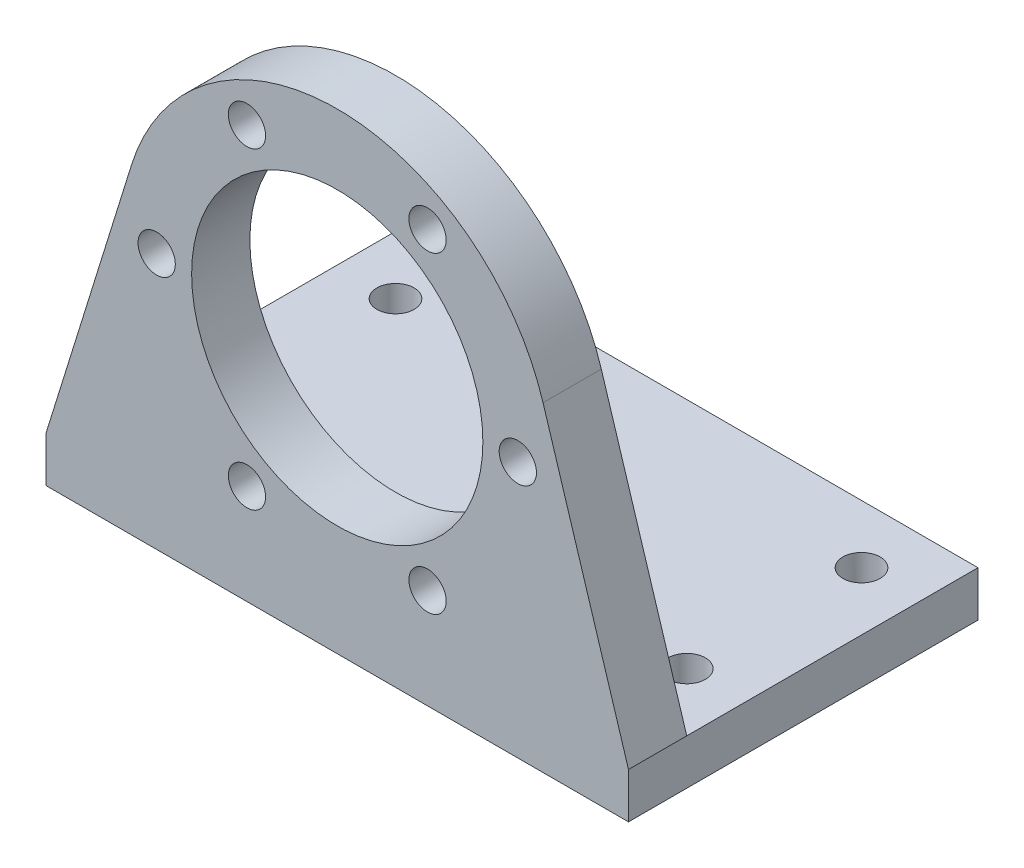
ISO-10303-21;
HEADER;
FILE_DESCRIPTION(('STEP AP214'),'2;1');
FILE_NAME('part.step','',(''),(''),'','','');
FILE_SCHEMA(('AUTOMOTIVE_DESIGN { 1 0 10303 214 1 1 1 1 }'));
ENDSEC;
DATA;
#1=APPLICATION_CONTEXT('core data for automotive mechanical design processes');
#2=APPLICATION_PROTOCOL_DEFINITION('international standard','automotive_design',2000,#1);
#3=PRODUCT_CONTEXT('',#1,'mechanical');
#4=PRODUCT('Part','Part','',(#3));
#5=PRODUCT_RELATED_PRODUCT_CATEGORY('part','',(#4));
#6=PRODUCT_DEFINITION_FORMATION('','',#4);
#7=PRODUCT_DEFINITION_CONTEXT('part definition',#1,'design');
#8=PRODUCT_DEFINITION('design','',#6,#7);
#9=PRODUCT_DEFINITION_SHAPE('','',#8);
#10=(LENGTH_UNIT() NAMED_UNIT(*) SI_UNIT(.MILLI.,.METRE.));
#11=(NAMED_UNIT(*) PLANE_ANGLE_UNIT() SI_UNIT($,.RADIAN.));
#12=(NAMED_UNIT(*) SI_UNIT($,.STERADIAN.) SOLID_ANGLE_UNIT());
#13=UNCERTAINTY_MEASURE_WITH_UNIT(LENGTH_MEASURE(1.E-05),#10,'distance_accuracy_value','');
#14=(GEOMETRIC_REPRESENTATION_CONTEXT(3) GLOBAL_UNCERTAINTY_ASSIGNED_CONTEXT((#13)) GLOBAL_UNIT_ASSIGNED_CONTEXT((#10,
#11,#12)) REPRESENTATION_CONTEXT('',''));
#15=CARTESIAN_POINT('',(0.,0.,0.));
#16=DIRECTION('',(0.,0.,1.));
#17=DIRECTION('',(1.,0.,0.));
#18=AXIS2_PLACEMENT_3D('',#15,#16,#17);
#19=CARTESIAN_POINT('',(0.,0.,0.));
#20=DIRECTION('',(0.,0.,1.));
#21=DIRECTION('',(1.,0.,0.));
#22=AXIS2_PLACEMENT_3D('',#19,#20,#21);
#23=PLANE('',#22);
#24=CARTESIAN_POINT('',(-7.75000000000016,-13.4233937586587,0.));
#25=DIRECTION('',(0.,0.,1.));
#26=DIRECTION('',(1.,0.,0.));
#27=AXIS2_PLACEMENT_3D('',#24,#25,#26);
#28=CIRCLE('',#27,1.6);
#29=CARTESIAN_POINT('',(-6.15000000000015,-13.4233937586587,0.));
#30=VERTEX_POINT('',#29);
#31=EDGE_CURVE('E190',#30,#30,#28,.T.);
#32=ORIENTED_EDGE('',*,*,#31,.T.);
#33=EDGE_LOOP('',(#32));
#34=FACE_BOUND('',#33,.T.);
#35=CARTESIAN_POINT('',(7.74999999999987,-13.4233937586589,0.));
#36=DIRECTION('',(0.,0.,1.));
#37=DIRECTION('',(1.,0.,0.));
#38=AXIS2_PLACEMENT_3D('',#35,#36,#37);
#39=CIRCLE('',#38,1.6);
#40=CARTESIAN_POINT('',(9.34999999999988,-13.4233937586589,0.));
#41=VERTEX_POINT('',#40);
#42=EDGE_CURVE('E195',#41,#41,#39,.T.);
#43=ORIENTED_EDGE('',*,*,#42,.T.);
#44=EDGE_LOOP('',(#43));
#45=FACE_BOUND('',#44,.T.);
#46=CARTESIAN_POINT('',(15.5,-1.08235921504137E-13,0.));
#47=DIRECTION('',(0.,0.,1.));
#48=DIRECTION('',(1.,0.,0.));
#49=AXIS2_PLACEMENT_3D('',#46,#47,#48);
#50=CIRCLE('',#49,1.6);
#51=CARTESIAN_POINT('',(17.1,-1.08235921504137E-13,0.));
#52=VERTEX_POINT('',#51);
#53=EDGE_CURVE('E203',#52,#52,#50,.T.);
#54=ORIENTED_EDGE('',*,*,#53,.T.);
#55=EDGE_LOOP('',(#54));
#56=FACE_BOUND('',#55,.T.);
#57=CARTESIAN_POINT('',(7.75000000000006,13.4233937586588,0.));
#58=DIRECTION('',(0.,0.,1.));
#59=DIRECTION('',(1.,0.,0.));
#60=AXIS2_PLACEMENT_3D('',#57,#58,#59);
#61=CIRCLE('',#60,1.6);
#62=CARTESIAN_POINT('',(9.35000000000006,13.4233937586588,0.));
#63=VERTEX_POINT('',#62);
#64=EDGE_CURVE('E211',#63,#63,#61,.T.);
#65=ORIENTED_EDGE('',*,*,#64,.T.);
#66=EDGE_LOOP('',(#65));
#67=FACE_BOUND('',#66,.T.);
#68=CARTESIAN_POINT('',(-7.74999999999997,13.4233937586588,0.));
#69=DIRECTION('',(0.,0.,1.));
#70=DIRECTION('',(1.,0.,0.));
#71=AXIS2_PLACEMENT_3D('',#68,#69,#70);
#72=CIRCLE('',#71,1.6);
#73=CARTESIAN_POINT('',(-6.14999999999997,13.4233937586588,0.));
#74=VERTEX_POINT('',#73);
#75=EDGE_CURVE('E219',#74,#74,#72,.T.);
#76=ORIENTED_EDGE('',*,*,#75,.T.);
#77=EDGE_LOOP('',(#76));
#78=FACE_BOUND('',#77,.T.);
#79=CARTESIAN_POINT('',(0.,0.,0.));
#80=DIRECTION('',(0.,0.,1.));
#81=DIRECTION('',(1.,0.,0.));
#82=AXIS2_PLACEMENT_3D('',#79,#80,#81);
#83=CIRCLE('',#82,12.5);
#84=CARTESIAN_POINT('',(12.5,0.,0.));
#85=VERTEX_POINT('',#84);
#86=EDGE_CURVE('E227',#85,#85,#83,.T.);
#87=ORIENTED_EDGE('',*,*,#86,.T.);
#88=EDGE_LOOP('',(#87));
#89=FACE_BOUND('',#88,.T.);
#90=CARTESIAN_POINT('',(-15.5,0.,0.));
#91=DIRECTION('',(0.,0.,1.));
#92=DIRECTION('',(1.,0.,0.));
#93=AXIS2_PLACEMENT_3D('',#90,#91,#92);
#94=CIRCLE('',#93,1.6);
#95=CARTESIAN_POINT('',(-13.9,0.,0.));
#96=VERTEX_POINT('',#95);
#97=EDGE_CURVE('E235',#96,#96,#94,.T.);
#98=ORIENTED_EDGE('',*,*,#97,.T.);
#99=EDGE_LOOP('',(#98));
#100=FACE_BOUND('',#99,.T.);
#101=DIRECTION('',(1.,0.,0.));
#102=VECTOR('',#101,1.);
#103=CARTESIAN_POINT('',(25.,-18.1033033888757,0.));
#104=LINE('',#103,#102);
#105=CARTESIAN_POINT('',(-25.,-18.1033033888757,0.));
#106=VERTEX_POINT('',#105);
#107=CARTESIAN_POINT('',(25.,-18.1033033888757,0.));
#108=VERTEX_POINT('',#107);
#109=EDGE_CURVE('E84',#106,#108,#104,.T.);
#110=ORIENTED_EDGE('',*,*,#109,.F.);
#111=DIRECTION('',(-0.296816662870677,-0.95493448395286,0.));
#112=VECTOR('',#111,1.);
#113=CARTESIAN_POINT('',(-25.,-18.1033033888757,0.));
#114=LINE('',#113,#112);
#115=CARTESIAN_POINT('',(-17.6662879531279,5.49110826310753,0.));
#116=VERTEX_POINT('',#115);
#117=EDGE_CURVE('E135',#116,#106,#114,.T.);
#118=ORIENTED_EDGE('',*,*,#117,.F.);
#119=CARTESIAN_POINT('',(0.,0.,0.));
#120=DIRECTION('',(0.,0.,1.));
#121=DIRECTION('',(1.,0.,0.));
#122=AXIS2_PLACEMENT_3D('',#119,#120,#121);
#123=CIRCLE('',#122,18.5);
#124=CARTESIAN_POINT('',(17.6662879531279,5.49110826310752,0.));
#125=VERTEX_POINT('',#124);
#126=EDGE_CURVE('E76',#125,#116,#123,.T.);
#127=ORIENTED_EDGE('',*,*,#126,.F.);
#128=DIRECTION('',(-0.296816662870677,0.95493448395286,0.));
#129=VECTOR('',#128,1.);
#130=CARTESIAN_POINT('',(25.,-18.1033033888757,0.));
#131=LINE('',#130,#129);
#132=EDGE_CURVE('E117',#108,#125,#131,.T.);
#133=ORIENTED_EDGE('',*,*,#132,.F.);
#134=EDGE_LOOP('',(#110,#118,#127,#133));
#135=FACE_BOUND('',#134,.T.);
#136=ADVANCED_FACE('F43',(#34,#45,#56,#67,#78,#89,#100,#135),#23,.F.);
#137=CARTESIAN_POINT('',(0.,0.,5.));
#138=DIRECTION('',(0.,0.,1.));
#139=DIRECTION('',(1.,0.,0.));
#140=AXIS2_PLACEMENT_3D('',#137,#138,#139);
#141=PLANE('',#140);
#142=CARTESIAN_POINT('',(7.74999999999987,-13.4233937586589,5.));
#143=DIRECTION('',(0.,0.,1.));
#144=DIRECTION('',(1.,0.,0.));
#145=AXIS2_PLACEMENT_3D('',#142,#143,#144);
#146=CIRCLE('',#145,1.6);
#147=CARTESIAN_POINT('',(9.34999999999988,-13.4233937586589,5.));
#148=VERTEX_POINT('',#147);
#149=EDGE_CURVE('E199',#148,#148,#146,.T.);
#150=ORIENTED_EDGE('',*,*,#149,.F.);
#151=EDGE_LOOP('',(#150));
#152=FACE_BOUND('',#151,.T.);
#153=CARTESIAN_POINT('',(7.75000000000006,13.4233937586588,5.));
#154=DIRECTION('',(0.,0.,1.));
#155=DIRECTION('',(1.,0.,0.));
#156=AXIS2_PLACEMENT_3D('',#153,#154,#155);
#157=CIRCLE('',#156,1.6);
#158=CARTESIAN_POINT('',(9.35000000000006,13.4233937586588,5.));
#159=VERTEX_POINT('',#158);
#160=EDGE_CURVE('E215',#159,#159,#157,.T.);
#161=ORIENTED_EDGE('',*,*,#160,.F.);
#162=EDGE_LOOP('',(#161));
#163=FACE_BOUND('',#162,.T.);
#164=CARTESIAN_POINT('',(0.,0.,5.));
#165=DIRECTION('',(0.,0.,1.));
#166=DIRECTION('',(1.,0.,0.));
#167=AXIS2_PLACEMENT_3D('',#164,#165,#166);
#168=CIRCLE('',#167,12.5);
#169=CARTESIAN_POINT('',(12.5,0.,5.));
#170=VERTEX_POINT('',#169);
#171=EDGE_CURVE('E231',#170,#170,#168,.T.);
#172=ORIENTED_EDGE('',*,*,#171,.F.);
#173=EDGE_LOOP('',(#172));
#174=FACE_BOUND('',#173,.T.);
#175=DIRECTION('',(0.,-1.,0.));
#176=VECTOR('',#175,1.);
#177=CARTESIAN_POINT('',(-25.,-22.,5.));
#178=LINE('',#177,#176);
#179=CARTESIAN_POINT('',(-25.,-18.1033033888757,5.));
#180=VERTEX_POINT('',#179);
#181=CARTESIAN_POINT('',(-25.,-22.,5.));
#182=VERTEX_POINT('',#181);
#183=EDGE_CURVE('E138',#180,#182,#178,.T.);
#184=ORIENTED_EDGE('',*,*,#183,.T.);
#185=DIRECTION('',(1.,0.,0.));
#186=VECTOR('',#185,1.);
#187=CARTESIAN_POINT('',(-25.,-22.,5.));
#188=LINE('',#187,#186);
#189=CARTESIAN_POINT('',(25.,-22.,5.));
#190=VERTEX_POINT('',#189);
#191=EDGE_CURVE('E92',#182,#190,#188,.T.);
#192=ORIENTED_EDGE('',*,*,#191,.T.);
#193=DIRECTION('',(0.,1.,0.));
#194=VECTOR('',#193,1.);
#195=CARTESIAN_POINT('',(25.,-22.,5.));
#196=LINE('',#195,#194);
#197=CARTESIAN_POINT('',(25.,-18.1033033888757,5.));
#198=VERTEX_POINT('',#197);
#199=EDGE_CURVE('E109',#190,#198,#196,.T.);
#200=ORIENTED_EDGE('',*,*,#199,.T.);
#201=DIRECTION('',(-0.296816662870677,0.95493448395286,0.));
#202=VECTOR('',#201,1.);
#203=CARTESIAN_POINT('',(25.,-18.1033033888757,5.));
#204=LINE('',#203,#202);
#205=CARTESIAN_POINT('',(17.6662879531279,5.49110826310752,5.));
#206=VERTEX_POINT('',#205);
#207=EDGE_CURVE('E102',#198,#206,#204,.T.);
#208=ORIENTED_EDGE('',*,*,#207,.T.);
#209=CARTESIAN_POINT('',(0.,0.,5.));
#210=DIRECTION('',(0.,0.,1.));
#211=DIRECTION('',(1.,0.,0.));
#212=AXIS2_PLACEMENT_3D('',#209,#210,#211);
#213=CIRCLE('',#212,18.5);
#214=CARTESIAN_POINT('',(-17.6662879531279,5.49110826310753,5.));
#215=VERTEX_POINT('',#214);
#216=EDGE_CURVE('E107',#206,#215,#213,.T.);
#217=ORIENTED_EDGE('',*,*,#216,.T.);
#218=DIRECTION('',(-0.296816662870677,-0.95493448395286,0.));
#219=VECTOR('',#218,1.);
#220=CARTESIAN_POINT('',(-25.,-18.1033033888757,5.));
#221=LINE('',#220,#219);
#222=EDGE_CURVE('E61',#215,#180,#221,.T.);
#223=ORIENTED_EDGE('',*,*,#222,.T.);
#224=EDGE_LOOP('',(#184,#192,#200,#208,#217,#223));
#225=FACE_BOUND('',#224,.T.);
#226=CARTESIAN_POINT('',(-15.5,0.,5.));
#227=DIRECTION('',(0.,0.,1.));
#228=DIRECTION('',(1.,0.,0.));
#229=AXIS2_PLACEMENT_3D('',#226,#227,#228);
#230=CIRCLE('',#229,1.6);
#231=CARTESIAN_POINT('',(-13.9,0.,5.));
#232=VERTEX_POINT('',#231);
#233=EDGE_CURVE('E132',#232,#232,#230,.T.);
#234=ORIENTED_EDGE('',*,*,#233,.F.);
#235=EDGE_LOOP('',(#234));
#236=FACE_BOUND('',#235,.T.);
#237=CARTESIAN_POINT('',(-7.74999999999997,13.4233937586588,5.));
#238=DIRECTION('',(0.,0.,1.));
#239=DIRECTION('',(1.,0.,0.));
#240=AXIS2_PLACEMENT_3D('',#237,#238,#239);
#241=CIRCLE('',#240,1.6);
#242=CARTESIAN_POINT('',(-6.14999999999997,13.4233937586588,5.));
#243=VERTEX_POINT('',#242);
#244=EDGE_CURVE('E223',#243,#243,#241,.T.);
#245=ORIENTED_EDGE('',*,*,#244,.F.);
#246=EDGE_LOOP('',(#245));
#247=FACE_BOUND('',#246,.T.);
#248=CARTESIAN_POINT('',(15.5,-1.08235921504137E-13,5.));
#249=DIRECTION('',(0.,0.,1.));
#250=DIRECTION('',(1.,0.,0.));
#251=AXIS2_PLACEMENT_3D('',#248,#249,#250);
#252=CIRCLE('',#251,1.6);
#253=CARTESIAN_POINT('',(17.1,-1.08235921504137E-13,5.));
#254=VERTEX_POINT('',#253);
#255=EDGE_CURVE('E207',#254,#254,#252,.T.);
#256=ORIENTED_EDGE('',*,*,#255,.F.);
#257=EDGE_LOOP('',(#256));
#258=FACE_BOUND('',#257,.T.);
#259=CARTESIAN_POINT('',(-7.75000000000016,-13.4233937586587,5.));
#260=DIRECTION('',(0.,0.,1.));
#261=DIRECTION('',(1.,0.,0.));
#262=AXIS2_PLACEMENT_3D('',#259,#260,#261);
#263=CIRCLE('',#262,1.6);
#264=CARTESIAN_POINT('',(-6.15000000000015,-13.4233937586587,5.));
#265=VERTEX_POINT('',#264);
#266=EDGE_CURVE('E191',#265,#265,#263,.T.);
#267=ORIENTED_EDGE('',*,*,#266,.F.);
#268=EDGE_LOOP('',(#267));
#269=FACE_BOUND('',#268,.T.);
#270=ADVANCED_FACE('F104',(#152,#163,#174,#225,#236,#247,#258,#269),#141,.T.);
#271=CARTESIAN_POINT('',(-25.,-22.,5.));
#272=DIRECTION('',(1.,0.,0.));
#273=DIRECTION('',(0.,0.,-1.));
#274=AXIS2_PLACEMENT_3D('',#271,#272,#273);
#275=PLANE('',#274);
#276=DIRECTION('',(0.,0.,-1.));
#277=VECTOR('',#276,1.);
#278=CARTESIAN_POINT('',(-25.,-18.1033033888757,5.));
#279=LINE('',#278,#277);
#280=EDGE_CURVE('E126',#180,#106,#279,.T.);
#281=ORIENTED_EDGE('',*,*,#280,.T.);
#282=DIRECTION('',(0.,0.,1.));
#283=VECTOR('',#282,1.);
#284=CARTESIAN_POINT('',(-25.,-18.1033033888757,-25.));
#285=LINE('',#284,#283);
#286=CARTESIAN_POINT('',(-25.,-18.1033033888757,-25.));
#287=VERTEX_POINT('',#286);
#288=EDGE_CURVE('E186',#287,#106,#285,.T.);
#289=ORIENTED_EDGE('',*,*,#288,.F.);
#290=DIRECTION('',(0.,1.,0.));
#291=VECTOR('',#290,1.);
#292=CARTESIAN_POINT('',(-25.,-18.1033033888757,-25.));
#293=LINE('',#292,#291);
#294=CARTESIAN_POINT('',(-25.,-22.,-25.));
#295=VERTEX_POINT('',#294);
#296=EDGE_CURVE('E172',#295,#287,#293,.T.);
#297=ORIENTED_EDGE('',*,*,#296,.F.);
#298=DIRECTION('',(0.,0.,-1.));
#299=VECTOR('',#298,1.);
#300=CARTESIAN_POINT('',(-25.,-22.,5.));
#301=LINE('',#300,#299);
#302=EDGE_CURVE('E11',#182,#295,#301,.T.);
#303=ORIENTED_EDGE('',*,*,#302,.F.);
#304=ORIENTED_EDGE('',*,*,#183,.F.);
#305=EDGE_LOOP('',(#281,#289,#297,#303,#304));
#306=FACE_BOUND('',#305,.T.);
#307=ADVANCED_FACE('F45',(#306),#275,.F.);
#308=CARTESIAN_POINT('',(-25.,-22.,5.));
#309=DIRECTION('',(0.,1.,0.));
#310=DIRECTION('',(0.,0.,1.));
#311=AXIS2_PLACEMENT_3D('',#308,#309,#310);
#312=PLANE('',#311);
#313=CARTESIAN_POINT('',(-20.,-22.,-5.));
#314=DIRECTION('',(0.,1.,0.));
#315=DIRECTION('',(0.,0.,1.));
#316=AXIS2_PLACEMENT_3D('',#313,#314,#315);
#317=CIRCLE('',#316,1.6);
#318=CARTESIAN_POINT('',(-20.,-22.,-3.4));
#319=VERTEX_POINT('',#318);
#320=EDGE_CURVE('E177',#319,#319,#317,.T.);
#321=ORIENTED_EDGE('',*,*,#320,.T.);
#322=EDGE_LOOP('',(#321));
#323=FACE_BOUND('',#322,.T.);
#324=CARTESIAN_POINT('',(20.,-22.,-4.99999999999999));
#325=DIRECTION('',(0.,1.,0.));
#326=DIRECTION('',(0.,0.,1.));
#327=AXIS2_PLACEMENT_3D('',#324,#325,#326);
#328=CIRCLE('',#327,1.6);
#329=CARTESIAN_POINT('',(20.,-22.,-3.39999999999999));
#330=VERTEX_POINT('',#329);
#331=EDGE_CURVE('E305',#330,#330,#328,.T.);
#332=ORIENTED_EDGE('',*,*,#331,.T.);
#333=EDGE_LOOP('',(#332));
#334=FACE_BOUND('',#333,.T.);
#335=CARTESIAN_POINT('',(20.,-22.,-20.));
#336=DIRECTION('',(0.,1.,0.));
#337=DIRECTION('',(0.,0.,1.));
#338=AXIS2_PLACEMENT_3D('',#335,#336,#337);
#339=CIRCLE('',#338,1.6);
#340=CARTESIAN_POINT('',(20.,-22.,-18.4));
#341=VERTEX_POINT('',#340);
#342=EDGE_CURVE('E309',#341,#341,#339,.T.);
#343=ORIENTED_EDGE('',*,*,#342,.T.);
#344=EDGE_LOOP('',(#343));
#345=FACE_BOUND('',#344,.T.);
#346=CARTESIAN_POINT('',(-20.,-22.,-20.));
#347=DIRECTION('',(0.,1.,0.));
#348=DIRECTION('',(0.,0.,1.));
#349=AXIS2_PLACEMENT_3D('',#346,#347,#348);
#350=CIRCLE('',#349,1.6);
#351=CARTESIAN_POINT('',(-20.,-22.,-18.4));
#352=VERTEX_POINT('',#351);
#353=EDGE_CURVE('E312',#352,#352,#350,.T.);
#354=ORIENTED_EDGE('',*,*,#353,.T.);
#355=EDGE_LOOP('',(#354));
#356=FACE_BOUND('',#355,.T.);
#357=ORIENTED_EDGE('',*,*,#302,.T.);
#358=DIRECTION('',(-1.,0.,0.));
#359=VECTOR('',#358,1.);
#360=CARTESIAN_POINT('',(-25.,-22.,-25.));
#361=LINE('',#360,#359);
#362=CARTESIAN_POINT('',(25.,-22.,-25.));
#363=VERTEX_POINT('',#362);
#364=EDGE_CURVE('E161',#363,#295,#361,.T.);
#365=ORIENTED_EDGE('',*,*,#364,.F.);
#366=DIRECTION('',(0.,0.,-1.));
#367=VECTOR('',#366,1.);
#368=CARTESIAN_POINT('',(25.,-22.,5.));
#369=LINE('',#368,#367);
#370=EDGE_CURVE('E53',#190,#363,#369,.T.);
#371=ORIENTED_EDGE('',*,*,#370,.F.);
#372=ORIENTED_EDGE('',*,*,#191,.F.);
#373=EDGE_LOOP('',(#357,#365,#371,#372));
#374=FACE_BOUND('',#373,.T.);
#375=ADVANCED_FACE('F168',(#323,#334,#345,#356,#374),#312,.F.);
#376=CARTESIAN_POINT('',(25.,-22.,5.));
#377=DIRECTION('',(-1.,0.,0.));
#378=DIRECTION('',(0.,0.,1.));
#379=AXIS2_PLACEMENT_3D('',#376,#377,#378);
#380=PLANE('',#379);
#381=ORIENTED_EDGE('',*,*,#370,.T.);
#382=DIRECTION('',(0.,-1.,0.));
#383=VECTOR('',#382,1.);
#384=CARTESIAN_POINT('',(25.,-22.,-25.));
#385=LINE('',#384,#383);
#386=CARTESIAN_POINT('',(25.,-18.1033033888757,-25.));
#387=VERTEX_POINT('',#386);
#388=EDGE_CURVE('E153',#387,#363,#385,.T.);
#389=ORIENTED_EDGE('',*,*,#388,.F.);
#390=DIRECTION('',(0.,0.,1.));
#391=VECTOR('',#390,1.);
#392=CARTESIAN_POINT('',(25.,-18.1033033888757,-25.));
#393=LINE('',#392,#391);
#394=EDGE_CURVE('E166',#387,#108,#393,.T.);
#395=ORIENTED_EDGE('',*,*,#394,.T.);
#396=DIRECTION('',(0.,0.,-1.));
#397=VECTOR('',#396,1.);
#398=CARTESIAN_POINT('',(25.,-18.1033033888757,5.));
#399=LINE('',#398,#397);
#400=EDGE_CURVE('E119',#198,#108,#399,.T.);
#401=ORIENTED_EDGE('',*,*,#400,.F.);
#402=ORIENTED_EDGE('',*,*,#199,.F.);
#403=EDGE_LOOP('',(#381,#389,#395,#401,#402));
#404=FACE_BOUND('',#403,.T.);
#405=ADVANCED_FACE('F150',(#404),#380,.F.);
#406=CARTESIAN_POINT('',(25.,-18.1033033888757,5.));
#407=DIRECTION('',(-0.95493448395286,-0.296816662870677,0.));
#408=DIRECTION('',(0.296816662870677,-0.95493448395286,0.));
#409=AXIS2_PLACEMENT_3D('',#406,#407,#408);
#410=PLANE('',#409);
#411=ORIENTED_EDGE('',*,*,#132,.T.);
#412=DIRECTION('',(0.,0.,-1.));
#413=VECTOR('',#412,1.);
#414=CARTESIAN_POINT('',(17.6662879531279,5.49110826310752,5.));
#415=LINE('',#414,#413);
#416=EDGE_CURVE('E115',#206,#125,#415,.T.);
#417=ORIENTED_EDGE('',*,*,#416,.F.);
#418=ORIENTED_EDGE('',*,*,#207,.F.);
#419=ORIENTED_EDGE('',*,*,#400,.T.);
#420=EDGE_LOOP('',(#411,#417,#418,#419));
#421=FACE_BOUND('',#420,.T.);
#422=ADVANCED_FACE('F116',(#421),#410,.F.);
#423=CARTESIAN_POINT('',(0.,0.,5.));
#424=DIRECTION('',(0.,0.,-1.));
#425=DIRECTION('',(-1.,0.,0.));
#426=AXIS2_PLACEMENT_3D('',#423,#424,#425);
#427=CYLINDRICAL_SURFACE('',#426,18.5);
#428=ORIENTED_EDGE('',*,*,#126,.T.);
#429=DIRECTION('',(0.,0.,-1.));
#430=VECTOR('',#429,1.);
#431=CARTESIAN_POINT('',(-17.6662879531279,5.49110826310753,5.));
#432=LINE('',#431,#430);
#433=EDGE_CURVE('E120',#215,#116,#432,.T.);
#434=ORIENTED_EDGE('',*,*,#433,.F.);
#435=ORIENTED_EDGE('',*,*,#216,.F.);
#436=ORIENTED_EDGE('',*,*,#416,.T.);
#437=EDGE_LOOP('',(#428,#434,#435,#436));
#438=FACE_BOUND('',#437,.T.);
#439=ADVANCED_FACE('F122',(#438),#427,.T.);
#440=CARTESIAN_POINT('',(-25.,-18.1033033888757,5.));
#441=DIRECTION('',(0.95493448395286,-0.296816662870677,0.));
#442=DIRECTION('',(0.296816662870677,0.95493448395286,0.));
#443=AXIS2_PLACEMENT_3D('',#440,#441,#442);
#444=PLANE('',#443);
#445=ORIENTED_EDGE('',*,*,#117,.T.);
#446=ORIENTED_EDGE('',*,*,#280,.F.);
#447=ORIENTED_EDGE('',*,*,#222,.F.);
#448=ORIENTED_EDGE('',*,*,#433,.T.);
#449=EDGE_LOOP('',(#445,#446,#447,#448));
#450=FACE_BOUND('',#449,.T.);
#451=ADVANCED_FACE('F284',(#450),#444,.F.);
#452=CARTESIAN_POINT('',(-15.5,0.,5.));
#453=DIRECTION('',(0.,0.,-1.));
#454=DIRECTION('',(-1.,0.,0.));
#455=AXIS2_PLACEMENT_3D('',#452,#453,#454);
#456=CYLINDRICAL_SURFACE('',#455,1.6);
#457=ORIENTED_EDGE('',*,*,#233,.T.);
#458=EDGE_LOOP('',(#457));
#459=FACE_BOUND('',#458,.T.);
#460=ORIENTED_EDGE('',*,*,#97,.F.);
#461=EDGE_LOOP('',(#460));
#462=FACE_BOUND('',#461,.T.);
#463=ADVANCED_FACE('F287',(#459,#462),#456,.F.);
#464=CARTESIAN_POINT('',(0.,0.,5.));
#465=DIRECTION('',(0.,0.,-1.));
#466=DIRECTION('',(-1.,0.,0.));
#467=AXIS2_PLACEMENT_3D('',#464,#465,#466);
#468=CYLINDRICAL_SURFACE('',#467,12.5);
#469=ORIENTED_EDGE('',*,*,#171,.T.);
#470=EDGE_LOOP('',(#469));
#471=FACE_BOUND('',#470,.T.);
#472=ORIENTED_EDGE('',*,*,#86,.F.);
#473=EDGE_LOOP('',(#472));
#474=FACE_BOUND('',#473,.T.);
#475=ADVANCED_FACE('F484',(#471,#474),#468,.F.);
#476=CARTESIAN_POINT('',(-7.74999999999997,13.4233937586588,5.));
#477=DIRECTION('',(0.,0.,-1.));
#478=DIRECTION('',(-1.,0.,0.));
#479=AXIS2_PLACEMENT_3D('',#476,#477,#478);
#480=CYLINDRICAL_SURFACE('',#479,1.6);
#481=ORIENTED_EDGE('',*,*,#244,.T.);
#482=EDGE_LOOP('',(#481));
#483=FACE_BOUND('',#482,.T.);
#484=ORIENTED_EDGE('',*,*,#75,.F.);
#485=EDGE_LOOP('',(#484));
#486=FACE_BOUND('',#485,.T.);
#487=ADVANCED_FACE('F473',(#483,#486),#480,.F.);
#488=CARTESIAN_POINT('',(7.75000000000006,13.4233937586588,5.));
#489=DIRECTION('',(0.,0.,-1.));
#490=DIRECTION('',(-1.,0.,0.));
#491=AXIS2_PLACEMENT_3D('',#488,#489,#490);
#492=CYLINDRICAL_SURFACE('',#491,1.6);
#493=ORIENTED_EDGE('',*,*,#160,.T.);
#494=EDGE_LOOP('',(#493));
#495=FACE_BOUND('',#494,.T.);
#496=ORIENTED_EDGE('',*,*,#64,.F.);
#497=EDGE_LOOP('',(#496));
#498=FACE_BOUND('',#497,.T.);
#499=ADVANCED_FACE('F462',(#495,#498),#492,.F.);
#500=CARTESIAN_POINT('',(15.5,-1.08235921504137E-13,5.));
#501=DIRECTION('',(0.,0.,-1.));
#502=DIRECTION('',(-1.,0.,0.));
#503=AXIS2_PLACEMENT_3D('',#500,#501,#502);
#504=CYLINDRICAL_SURFACE('',#503,1.6);
#505=ORIENTED_EDGE('',*,*,#255,.T.);
#506=EDGE_LOOP('',(#505));
#507=FACE_BOUND('',#506,.T.);
#508=ORIENTED_EDGE('',*,*,#53,.F.);
#509=EDGE_LOOP('',(#508));
#510=FACE_BOUND('',#509,.T.);
#511=ADVANCED_FACE('F451',(#507,#510),#504,.F.);
#512=CARTESIAN_POINT('',(7.74999999999987,-13.4233937586589,5.));
#513=DIRECTION('',(0.,0.,-1.));
#514=DIRECTION('',(-1.,0.,0.));
#515=AXIS2_PLACEMENT_3D('',#512,#513,#514);
#516=CYLINDRICAL_SURFACE('',#515,1.6);
#517=ORIENTED_EDGE('',*,*,#149,.T.);
#518=EDGE_LOOP('',(#517));
#519=FACE_BOUND('',#518,.T.);
#520=ORIENTED_EDGE('',*,*,#42,.F.);
#521=EDGE_LOOP('',(#520));
#522=FACE_BOUND('',#521,.T.);
#523=ADVANCED_FACE('F268',(#519,#522),#516,.F.);
#524=CARTESIAN_POINT('',(-7.75000000000016,-13.4233937586587,5.));
#525=DIRECTION('',(0.,0.,-1.));
#526=DIRECTION('',(-1.,0.,0.));
#527=AXIS2_PLACEMENT_3D('',#524,#525,#526);
#528=CYLINDRICAL_SURFACE('',#527,1.6);
#529=ORIENTED_EDGE('',*,*,#266,.T.);
#530=EDGE_LOOP('',(#529));
#531=FACE_BOUND('',#530,.T.);
#532=ORIENTED_EDGE('',*,*,#31,.F.);
#533=EDGE_LOOP('',(#532));
#534=FACE_BOUND('',#533,.T.);
#535=ADVANCED_FACE('F259',(#531,#534),#528,.F.);
#536=CARTESIAN_POINT('',(25.,-18.1033033888757,-25.));
#537=DIRECTION('',(0.,-1.,0.));
#538=DIRECTION('',(0.,0.,-1.));
#539=AXIS2_PLACEMENT_3D('',#536,#537,#538);
#540=PLANE('',#539);
#541=CARTESIAN_POINT('',(-20.,-18.1033033888757,-5.));
#542=DIRECTION('',(0.,1.,0.));
#543=DIRECTION('',(0.,0.,-1.));
#544=AXIS2_PLACEMENT_3D('',#541,#542,#543);
#545=CIRCLE('',#544,1.6);
#546=CARTESIAN_POINT('',(-20.,-18.1033033888757,-6.6));
#547=VERTEX_POINT('',#546);
#548=EDGE_CURVE('E326',#547,#547,#545,.T.);
#549=ORIENTED_EDGE('',*,*,#548,.F.);
#550=EDGE_LOOP('',(#549));
#551=FACE_BOUND('',#550,.T.);
#552=CARTESIAN_POINT('',(20.,-18.1033033888757,-4.99999999999999));
#553=DIRECTION('',(0.,1.,0.));
#554=DIRECTION('',(0.,0.,1.));
#555=AXIS2_PLACEMENT_3D('',#552,#553,#554);
#556=CIRCLE('',#555,1.6);
#557=CARTESIAN_POINT('',(20.,-18.1033033888757,-3.39999999999999));
#558=VERTEX_POINT('',#557);
#559=EDGE_CURVE('E330',#558,#558,#556,.T.);
#560=ORIENTED_EDGE('',*,*,#559,.F.);
#561=EDGE_LOOP('',(#560));
#562=FACE_BOUND('',#561,.T.);
#563=CARTESIAN_POINT('',(20.,-18.1033033888757,-20.));
#564=DIRECTION('',(0.,1.,0.));
#565=DIRECTION('',(0.,0.,-1.));
#566=AXIS2_PLACEMENT_3D('',#563,#564,#565);
#567=CIRCLE('',#566,1.6);
#568=CARTESIAN_POINT('',(20.,-18.1033033888757,-21.6));
#569=VERTEX_POINT('',#568);
#570=EDGE_CURVE('E321',#569,#569,#567,.T.);
#571=ORIENTED_EDGE('',*,*,#570,.F.);
#572=EDGE_LOOP('',(#571));
#573=FACE_BOUND('',#572,.T.);
#574=CARTESIAN_POINT('',(-20.,-18.1033033888757,-20.));
#575=DIRECTION('',(0.,1.,0.));
#576=DIRECTION('',(0.,0.,1.));
#577=AXIS2_PLACEMENT_3D('',#574,#575,#576);
#578=CIRCLE('',#577,1.6);
#579=CARTESIAN_POINT('',(-20.,-18.1033033888757,-18.4));
#580=VERTEX_POINT('',#579);
#581=EDGE_CURVE('E315',#580,#580,#578,.T.);
#582=ORIENTED_EDGE('',*,*,#581,.F.);
#583=EDGE_LOOP('',(#582));
#584=FACE_BOUND('',#583,.T.);
#585=ORIENTED_EDGE('',*,*,#109,.T.);
#586=ORIENTED_EDGE('',*,*,#394,.F.);
#587=DIRECTION('',(1.,0.,0.));
#588=VECTOR('',#587,1.);
#589=CARTESIAN_POINT('',(25.,-18.1033033888757,-25.));
#590=LINE('',#589,#588);
#591=EDGE_CURVE('E163',#287,#387,#590,.T.);
#592=ORIENTED_EDGE('',*,*,#591,.F.);
#593=ORIENTED_EDGE('',*,*,#288,.T.);
#594=EDGE_LOOP('',(#585,#586,#592,#593));
#595=FACE_BOUND('',#594,.T.);
#596=ADVANCED_FACE('F257',(#551,#562,#573,#584,#595),#540,.F.);
#597=CARTESIAN_POINT('',(0.,0.,-25.));
#598=DIRECTION('',(0.,0.,1.));
#599=DIRECTION('',(1.,0.,0.));
#600=AXIS2_PLACEMENT_3D('',#597,#598,#599);
#601=PLANE('',#600);
#602=ORIENTED_EDGE('',*,*,#364,.T.);
#603=ORIENTED_EDGE('',*,*,#296,.T.);
#604=ORIENTED_EDGE('',*,*,#591,.T.);
#605=ORIENTED_EDGE('',*,*,#388,.T.);
#606=EDGE_LOOP('',(#602,#603,#604,#605));
#607=FACE_BOUND('',#606,.T.);
#608=ADVANCED_FACE('F158',(#607),#601,.F.);
#609=CARTESIAN_POINT('',(-20.,-43.1033033888757,-20.));
#610=DIRECTION('',(0.,1.,0.));
#611=DIRECTION('',(0.,0.,1.));
#612=AXIS2_PLACEMENT_3D('',#609,#610,#611);
#613=CYLINDRICAL_SURFACE('',#612,1.6);
#614=ORIENTED_EDGE('',*,*,#581,.T.);
#615=EDGE_LOOP('',(#614));
#616=FACE_BOUND('',#615,.T.);
#617=ORIENTED_EDGE('',*,*,#353,.F.);
#618=EDGE_LOOP('',(#617));
#619=FACE_BOUND('',#618,.T.);
#620=ADVANCED_FACE('F266',(#616,#619),#613,.F.);
#621=CARTESIAN_POINT('',(20.,-43.1033033888757,-20.));
#622=DIRECTION('',(0.,1.,0.));
#623=DIRECTION('',(0.,0.,1.));
#624=AXIS2_PLACEMENT_3D('',#621,#622,#623);
#625=CYLINDRICAL_SURFACE('',#624,1.6);
#626=ORIENTED_EDGE('',*,*,#570,.T.);
#627=EDGE_LOOP('',(#626));
#628=FACE_BOUND('',#627,.T.);
#629=ORIENTED_EDGE('',*,*,#342,.F.);
#630=EDGE_LOOP('',(#629));
#631=FACE_BOUND('',#630,.T.);
#632=ADVANCED_FACE('F338',(#628,#631),#625,.F.);
#633=CARTESIAN_POINT('',(20.,-43.1033033888757,-4.99999999999999));
#634=DIRECTION('',(0.,1.,0.));
#635=DIRECTION('',(0.,0.,1.));
#636=AXIS2_PLACEMENT_3D('',#633,#634,#635);
#637=CYLINDRICAL_SURFACE('',#636,1.6);
#638=ORIENTED_EDGE('',*,*,#559,.T.);
#639=EDGE_LOOP('',(#638));
#640=FACE_BOUND('',#639,.T.);
#641=ORIENTED_EDGE('',*,*,#331,.F.);
#642=EDGE_LOOP('',(#641));
#643=FACE_BOUND('',#642,.T.);
#644=ADVANCED_FACE('F349',(#640,#643),#637,.F.);
#645=CARTESIAN_POINT('',(-20.,-43.1033033888757,-5.));
#646=DIRECTION('',(0.,1.,0.));
#647=DIRECTION('',(0.,0.,1.));
#648=AXIS2_PLACEMENT_3D('',#645,#646,#647);
#649=CYLINDRICAL_SURFACE('',#648,1.6);
#650=ORIENTED_EDGE('',*,*,#548,.T.);
#651=EDGE_LOOP('',(#650));
#652=FACE_BOUND('',#651,.T.);
#653=ORIENTED_EDGE('',*,*,#320,.F.);
#654=EDGE_LOOP('',(#653));
#655=FACE_BOUND('',#654,.T.);
#656=ADVANCED_FACE('F352',(#652,#655),#649,.F.);
#657=CLOSED_SHELL('',(#136,#270,#307,#375,#405,#422,#439,#451,#463,#475,#487,#499,#511,#523,
#535,#596,#608,#620,#632,#644,#656));
#658=MANIFOLD_SOLID_BREP('B2',#657);
#659=ADVANCED_BREP_SHAPE_REPRESENTATION('',(#18,#658),#14);
#660=SHAPE_DEFINITION_REPRESENTATION(#9,#659);
ENDSEC;
END-ISO-10303-21;
